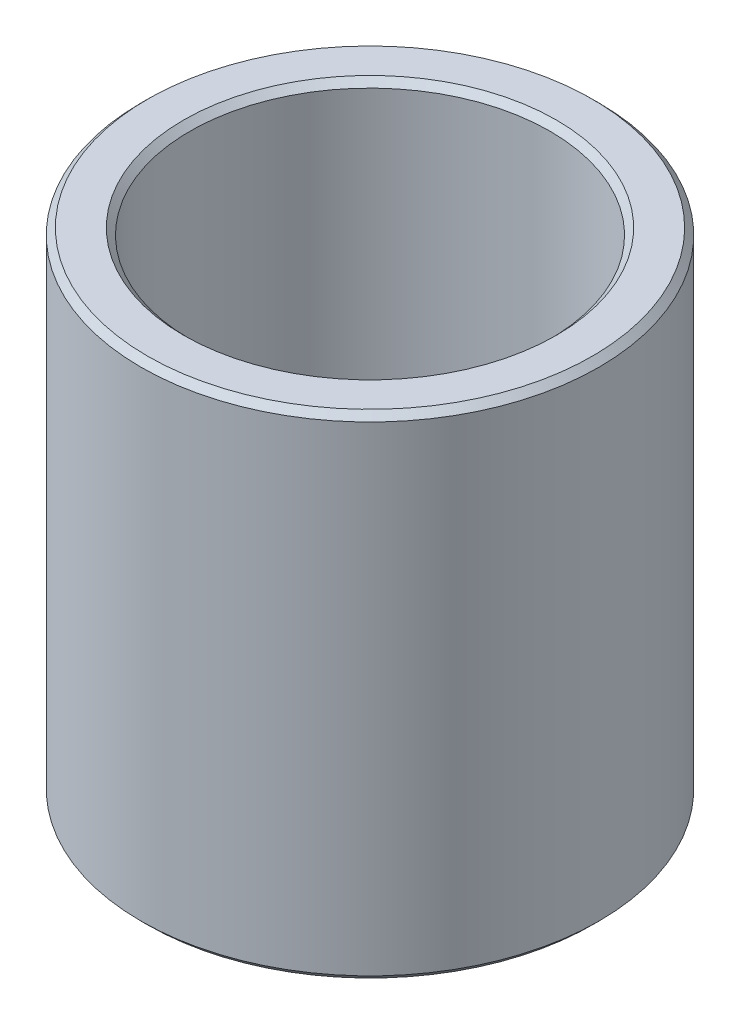
ISO-10303-21;
HEADER;
FILE_DESCRIPTION(('STEP AP214'),'2;1');
FILE_NAME('part.step','',(''),(''),'','','');
FILE_SCHEMA(('AUTOMOTIVE_DESIGN { 1 0 10303 214 1 1 1 1 }'));
ENDSEC;
DATA;
#1=APPLICATION_CONTEXT('core data for automotive mechanical design processes');
#2=APPLICATION_PROTOCOL_DEFINITION('international standard','automotive_design',2000,#1);
#3=PRODUCT_CONTEXT('',#1,'mechanical');
#4=PRODUCT('Part','Part','',(#3));
#5=PRODUCT_RELATED_PRODUCT_CATEGORY('part','',(#4));
#6=PRODUCT_DEFINITION_FORMATION('','',#4);
#7=PRODUCT_DEFINITION_CONTEXT('part definition',#1,'design');
#8=PRODUCT_DEFINITION('design','',#6,#7);
#9=PRODUCT_DEFINITION_SHAPE('','',#8);
#10=(LENGTH_UNIT() NAMED_UNIT(*) SI_UNIT(.MILLI.,.METRE.));
#11=(NAMED_UNIT(*) PLANE_ANGLE_UNIT() SI_UNIT($,.RADIAN.));
#12=(NAMED_UNIT(*) SI_UNIT($,.STERADIAN.) SOLID_ANGLE_UNIT());
#13=UNCERTAINTY_MEASURE_WITH_UNIT(LENGTH_MEASURE(1.E-05),#10,'distance_accuracy_value','');
#14=(GEOMETRIC_REPRESENTATION_CONTEXT(3) GLOBAL_UNCERTAINTY_ASSIGNED_CONTEXT((#13)) GLOBAL_UNIT_ASSIGNED_CONTEXT((#10,
#11,#12)) REPRESENTATION_CONTEXT('',''));
#15=CARTESIAN_POINT('',(0.,0.,0.));
#16=DIRECTION('',(0.,0.,1.));
#17=DIRECTION('',(1.,0.,0.));
#18=AXIS2_PLACEMENT_3D('',#15,#16,#17);
#19=CARTESIAN_POINT('',(0.,91.436440186991,0.));
#20=DIRECTION('',(0.,-1.,0.));
#21=DIRECTION('',(0.,0.,-1.));
#22=AXIS2_PLACEMENT_3D('',#19,#20,#21);
#23=CYLINDRICAL_SURFACE('',#22,42.5);
#24=CARTESIAN_POINT('',(0.,1.19448663631071,0.));
#25=DIRECTION('',(0.,1.,0.));
#26=DIRECTION('',(0.,0.,1.));
#27=AXIS2_PLACEMENT_3D('',#24,#25,#26);
#28=CIRCLE('',#27,42.5);
#29=CARTESIAN_POINT('',(0.,1.19448663631071,42.5));
#30=VERTEX_POINT('',#29);
#31=EDGE_CURVE('E10',#30,#30,#28,.T.);
#32=ORIENTED_EDGE('',*,*,#31,.T.);
#33=EDGE_LOOP('',(#32));
#34=FACE_BOUND('',#33,.T.);
#35=CARTESIAN_POINT('',(0.,90.2419535506802,0.));
#36=DIRECTION('',(0.,1.,0.));
#37=DIRECTION('',(0.,0.,1.));
#38=AXIS2_PLACEMENT_3D('',#35,#36,#37);
#39=CIRCLE('',#38,42.5);
#40=CARTESIAN_POINT('',(0.,90.2419535506802,42.5));
#41=VERTEX_POINT('',#40);
#42=EDGE_CURVE('E50',#41,#41,#39,.F.);
#43=ORIENTED_EDGE('',*,*,#42,.T.);
#44=EDGE_LOOP('',(#43));
#45=FACE_BOUND('',#44,.T.);
#46=ADVANCED_FACE('F39',(#34,#45),#23,.T.);
#47=CARTESIAN_POINT('',(0.,91.436440186991,0.));
#48=DIRECTION('',(0.,1.,0.));
#49=DIRECTION('',(0.,0.,1.));
#50=AXIS2_PLACEMENT_3D('',#47,#48,#49);
#51=PLANE('',#50);
#52=CARTESIAN_POINT('',(0.,91.436440186991,0.));
#53=DIRECTION('',(0.,1.,0.));
#54=DIRECTION('',(0.,0.,1.));
#55=AXIS2_PLACEMENT_3D('',#52,#53,#54);
#56=CIRCLE('',#55,34.6131338190383);
#57=CARTESIAN_POINT('',(0.,91.436440186991,34.6131338190383));
#58=VERTEX_POINT('',#57);
#59=EDGE_CURVE('E58',#58,#58,#56,.F.);
#60=ORIENTED_EDGE('',*,*,#59,.T.);
#61=EDGE_LOOP('',(#60));
#62=FACE_BOUND('',#61,.T.);
#63=CARTESIAN_POINT('',(0.,91.436440186991,0.));
#64=DIRECTION('',(0.,1.,0.));
#65=DIRECTION('',(0.,0.,1.));
#66=AXIS2_PLACEMENT_3D('',#63,#64,#65);
#67=CIRCLE('',#66,41.3055133636893);
#68=CARTESIAN_POINT('',(0.,91.436440186991,41.3055133636893));
#69=VERTEX_POINT('',#68);
#70=EDGE_CURVE('E61',#69,#69,#67,.T.);
#71=ORIENTED_EDGE('',*,*,#70,.T.);
#72=EDGE_LOOP('',(#71));
#73=FACE_BOUND('',#72,.T.);
#74=ADVANCED_FACE('F88',(#62,#73),#51,.T.);
#75=CARTESIAN_POINT('',(0.,0.,0.));
#76=DIRECTION('',(0.,1.,0.));
#77=DIRECTION('',(0.,0.,1.));
#78=AXIS2_PLACEMENT_3D('',#75,#76,#77);
#79=PLANE('',#78);
#80=CARTESIAN_POINT('',(0.,0.,0.));
#81=DIRECTION('',(0.,1.,0.));
#82=DIRECTION('',(0.,0.,1.));
#83=AXIS2_PLACEMENT_3D('',#80,#81,#82);
#84=CIRCLE('',#83,34.6131338190383);
#85=CARTESIAN_POINT('',(0.,0.,-34.6131338190383));
#86=VERTEX_POINT('',#85);
#87=EDGE_CURVE('E51',#86,#86,#84,.T.);
#88=ORIENTED_EDGE('',*,*,#87,.T.);
#89=EDGE_LOOP('',(#88));
#90=FACE_BOUND('',#89,.T.);
#91=CARTESIAN_POINT('',(0.,0.,0.));
#92=DIRECTION('',(0.,1.,0.));
#93=DIRECTION('',(0.,0.,1.));
#94=AXIS2_PLACEMENT_3D('',#91,#92,#93);
#95=CIRCLE('',#94,41.3055133636893);
#96=CARTESIAN_POINT('',(0.,0.,41.3055133636893));
#97=VERTEX_POINT('',#96);
#98=EDGE_CURVE('E54',#97,#97,#95,.F.);
#99=ORIENTED_EDGE('',*,*,#98,.T.);
#100=EDGE_LOOP('',(#99));
#101=FACE_BOUND('',#100,.T.);
#102=ADVANCED_FACE('F83',(#90,#101),#79,.F.);
#103=CARTESIAN_POINT('',(0.,91.436440186991,0.));
#104=DIRECTION('',(0.,-1.,0.));
#105=DIRECTION('',(0.,0.,-1.));
#106=AXIS2_PLACEMENT_3D('',#103,#104,#105);
#107=CYLINDRICAL_SURFACE('',#106,33.4186471827276);
#108=CARTESIAN_POINT('',(0.,90.2419535506803,0.));
#109=DIRECTION('',(0.,1.,0.));
#110=DIRECTION('',(0.,0.,1.));
#111=AXIS2_PLACEMENT_3D('',#108,#109,#110);
#112=CIRCLE('',#111,33.4186471827276);
#113=CARTESIAN_POINT('',(0.,90.2419535506803,33.4186471827276));
#114=VERTEX_POINT('',#113);
#115=EDGE_CURVE('E67',#114,#114,#112,.T.);
#116=ORIENTED_EDGE('',*,*,#115,.T.);
#117=EDGE_LOOP('',(#116));
#118=FACE_BOUND('',#117,.T.);
#119=CARTESIAN_POINT('',(0.,1.19448663631072,0.));
#120=DIRECTION('',(0.,1.,0.));
#121=DIRECTION('',(0.,0.,1.));
#122=AXIS2_PLACEMENT_3D('',#119,#120,#121);
#123=CIRCLE('',#122,33.4186471827276);
#124=CARTESIAN_POINT('',(0.,1.19448663631072,-33.4186471827276));
#125=VERTEX_POINT('',#124);
#126=EDGE_CURVE('E69',#125,#125,#123,.F.);
#127=ORIENTED_EDGE('',*,*,#126,.T.);
#128=EDGE_LOOP('',(#127));
#129=FACE_BOUND('',#128,.T.);
#130=ADVANCED_FACE('F71',(#118,#129),#107,.F.);
#131=CARTESIAN_POINT('',(0.,90.2419535506803,0.));
#132=DIRECTION('',(0.,1.,0.));
#133=DIRECTION('',(0.,0.,1.));
#134=AXIS2_PLACEMENT_3D('',#131,#132,#133);
#135=CONICAL_SURFACE('',#134,33.4186471827276,0.785398163397451);
#136=ORIENTED_EDGE('',*,*,#59,.F.);
#137=EDGE_LOOP('',(#136));
#138=FACE_BOUND('',#137,.T.);
#139=ORIENTED_EDGE('',*,*,#115,.F.);
#140=EDGE_LOOP('',(#139));
#141=FACE_BOUND('',#140,.T.);
#142=ADVANCED_FACE('F77',(#138,#141),#135,.F.);
#143=CARTESIAN_POINT('',(0.,0.,0.));
#144=DIRECTION('',(0.,-1.,0.));
#145=DIRECTION('',(0.,0.,-1.));
#146=AXIS2_PLACEMENT_3D('',#143,#144,#145);
#147=CONICAL_SURFACE('',#146,34.6131338190383,0.785398163397445);
#148=CARTESIAN_POINT('',(0.,1.19448663631072,-33.4186471827276));
#149=CARTESIAN_POINT('',(0.,1.18204406718248,-33.4310897518558));
#150=CARTESIAN_POINT('',(0.,1.16960149805425,-33.443532320984));
#151=CARTESIAN_POINT('',(0.,1.14471635979777,-33.4684174592405));
#152=CARTESIAN_POINT('',(0.,1.13227379066954,-33.4808600283688));
#153=CARTESIAN_POINT('',(0.,1.10738865241306,-33.5057451666252));
#154=CARTESIAN_POINT('',(0.,1.09494608328483,-33.5181877357535));
#155=CARTESIAN_POINT('',(0.,1.07006094502835,-33.5430728740099));
#156=CARTESIAN_POINT('',(0.,1.05761837590012,-33.5555154431382));
#157=CARTESIAN_POINT('',(0.,1.03273323764364,-33.5804005813946));
#158=CARTESIAN_POINT('',(0.,1.02029066851541,-33.5928431505229));
#159=CARTESIAN_POINT('',(0.,0.995405530258934,-33.6177282887794));
#160=CARTESIAN_POINT('',(0.,0.982962961130697,-33.6301708579076));
#161=CARTESIAN_POINT('',(0.,0.958077822874224,-33.6550559961641));
#162=CARTESIAN_POINT('',(0.,0.945635253745987,-33.6674985652923));
#163=CARTESIAN_POINT('',(0.,0.920750115489514,-33.6923837035488));
#164=CARTESIAN_POINT('',(0.,0.908307546361277,-33.704826272677));
#165=CARTESIAN_POINT('',(0.,0.883422408104804,-33.7297114109335));
#166=CARTESIAN_POINT('',(0.,0.870979838976567,-33.7421539800617));
#167=CARTESIAN_POINT('',(0.,0.846094700720094,-33.7670391183182));
#168=CARTESIAN_POINT('',(0.,0.833652131591857,-33.7794816874464));
#169=CARTESIAN_POINT('',(0.,0.808766993335384,-33.8043668257029));
#170=CARTESIAN_POINT('',(0.,0.796324424207147,-33.8168093948311));
#171=CARTESIAN_POINT('',(0.,0.771439285950674,-33.8416945330876));
#172=CARTESIAN_POINT('',(0.,0.758996716822437,-33.8541371022159));
#173=CARTESIAN_POINT('',(0.,0.734111578565964,-33.8790222404723));
#174=CARTESIAN_POINT('',(0.,0.721669009437727,-33.8914648096006));
#175=CARTESIAN_POINT('',(0.,0.696783871181254,-33.916349947857));
#176=CARTESIAN_POINT('',(0.,0.684341302053017,-33.9287925169853));
#177=CARTESIAN_POINT('',(0.,0.659456163796544,-33.9536776552417));
#178=CARTESIAN_POINT('',(0.,0.647013594668308,-33.96612022437));
#179=CARTESIAN_POINT('',(0.,0.622128456411834,-33.9910053626265));
#180=CARTESIAN_POINT('',(0.,0.609685887283597,-34.0034479317547));
#181=CARTESIAN_POINT('',(0.,0.584800749027123,-34.0283330700112));
#182=CARTESIAN_POINT('',(0.,0.572358179898887,-34.0407756391394));
#183=CARTESIAN_POINT('',(0.,0.547473041642414,-34.0656607773959));
#184=CARTESIAN_POINT('',(0.,0.535030472514177,-34.0781033465241));
#185=CARTESIAN_POINT('',(0.,0.510145334257704,-34.1029884847806));
#186=CARTESIAN_POINT('',(0.,0.497702765129467,-34.1154310539088));
#187=CARTESIAN_POINT('',(0.,0.472817626872994,-34.1403161921653));
#188=CARTESIAN_POINT('',(0.,0.460375057744757,-34.1527587612935));
#189=CARTESIAN_POINT('',(0.,0.435489919488284,-34.17764389955));
#190=CARTESIAN_POINT('',(0.,0.423047350360047,-34.1900864686782));
#191=CARTESIAN_POINT('',(0.,0.398162212103574,-34.2149716069347));
#192=CARTESIAN_POINT('',(0.,0.385719642975337,-34.2274141760629));
#193=CARTESIAN_POINT('',(0.,0.360834504718864,-34.2522993143194));
#194=CARTESIAN_POINT('',(0.,0.348391935590627,-34.2647418834477));
#195=CARTESIAN_POINT('',(0.,0.323506797334154,-34.2896270217041));
#196=CARTESIAN_POINT('',(0.,0.311064228205917,-34.3020695908324));
#197=CARTESIAN_POINT('',(0.,0.286179089949444,-34.3269547290888));
#198=CARTESIAN_POINT('',(0.,0.273736520821207,-34.3393972982171));
#199=CARTESIAN_POINT('',(0.,0.248851382564733,-34.3642824364736));
#200=CARTESIAN_POINT('',(0.,0.236408813436497,-34.3767250056018));
#201=CARTESIAN_POINT('',(0.,0.211523675180023,-34.4016101438583));
#202=CARTESIAN_POINT('',(0.,0.199081106051787,-34.4140527129865));
#203=CARTESIAN_POINT('',(0.,0.174195967795313,-34.438937851243));
#204=CARTESIAN_POINT('',(0.,0.161753398667077,-34.4513804203712));
#205=CARTESIAN_POINT('',(0.,0.136868260410603,-34.4762655586277));
#206=CARTESIAN_POINT('',(0.,0.124425691282367,-34.4887081277559));
#207=CARTESIAN_POINT('',(0.,0.0995405530258934,-34.5135932660124));
#208=CARTESIAN_POINT('',(0.,0.0870979838976567,-34.5260358351406));
#209=CARTESIAN_POINT('',(0.,0.0622128456411834,-34.5509209733971));
#210=CARTESIAN_POINT('',(0.,0.0497702765129467,-34.5633635425253));
#211=CARTESIAN_POINT('',(0.,0.0248851382564734,-34.5882486807818));
#212=CARTESIAN_POINT('',(0.,0.0124425691282367,-34.60069124991));
#213=CARTESIAN_POINT('',(0.,0.,-34.6131338190383));
#214=B_SPLINE_CURVE_WITH_KNOTS('',3,(#148,#149,#150,#151,#152,#153,#154,#155,#156,#157,#158,
#159,#160,#161,#162,#163,#164,#165,#166,#167,#168,#169,#170,#171,#172,#173,#174,#175,#176,#177,
#178,#179,#180,#181,#182,#183,#184,#185,#186,#187,#188,#189,#190,#191,#192,#193,#194,#195,#196,
#197,#198,#199,#200,#201,#202,#203,#204,#205,#206,#207,#208,#209,#210,#211,#212,#213),
.UNSPECIFIED.,.F.,.F.,(4,2,2,2,2,2,2,2,2,2,2,2,2,2,2,2,2,2,2,2,2,2,2,2,2,2,2,2,2,2,2,2,4),(0.,
0.0527893500357513,0.105578700071503,0.158368050107254,0.211157400143005,0.263946750178756,
0.316736100214507,0.369525450250259,0.42231480028601,0.475104150321761,0.527893500357513,
0.580682850393264,0.633472200429015,0.686261550464766,0.739050900500518,0.791840250536269,
0.844629600572015,0.897418950607767,0.950208300643518,1.00299765067927,1.05578700071502,
1.10857635075077,1.16136570078652,1.21415505082227,1.26694440085803,1.31973375089378,
1.37252310092953,1.42531245096528,1.47810180100103,1.53089115103678,1.58368050107253,
1.63646985110828,1.68925920114403),.UNSPECIFIED.);
#215=EDGE_CURVE('BSEAM73',#125,#86,#214,.T.);
#216=ORIENTED_EDGE('',*,*,#126,.F.);
#217=ORIENTED_EDGE('',*,*,#87,.F.);
#218=ORIENTED_EDGE('',*,*,#215,.T.);
#219=ORIENTED_EDGE('',*,*,#215,.F.);
#220=EDGE_LOOP('',(#216,#218,#217,#219));
#221=FACE_BOUND('',#220,.T.);
#222=ADVANCED_FACE('F73',(#221),#147,.F.);
#223=CARTESIAN_POINT('',(0.,1.19448663631071,0.));
#224=DIRECTION('',(0.,1.,0.));
#225=DIRECTION('',(0.,0.,1.));
#226=AXIS2_PLACEMENT_3D('',#223,#224,#225);
#227=CONICAL_SURFACE('',#226,42.5,0.785398163397448);
#228=ORIENTED_EDGE('',*,*,#98,.F.);
#229=EDGE_LOOP('',(#228));
#230=FACE_BOUND('',#229,.T.);
#231=ORIENTED_EDGE('',*,*,#31,.F.);
#232=EDGE_LOOP('',(#231));
#233=FACE_BOUND('',#232,.T.);
#234=ADVANCED_FACE('F76',(#230,#233),#227,.T.);
#235=CARTESIAN_POINT('',(0.,91.436440186991,0.));
#236=DIRECTION('',(0.,-1.,0.));
#237=DIRECTION('',(0.,0.,-1.));
#238=AXIS2_PLACEMENT_3D('',#235,#236,#237);
#239=CONICAL_SURFACE('',#238,41.3055133636893,0.785398163397443);
#240=ORIENTED_EDGE('',*,*,#42,.F.);
#241=EDGE_LOOP('',(#240));
#242=FACE_BOUND('',#241,.T.);
#243=ORIENTED_EDGE('',*,*,#70,.F.);
#244=EDGE_LOOP('',(#243));
#245=FACE_BOUND('',#244,.T.);
#246=ADVANCED_FACE('F45',(#242,#245),#239,.T.);
#247=CLOSED_SHELL('',(#46,#74,#102,#130,#142,#222,#234,#246));
#248=MANIFOLD_SOLID_BREP('B2',#247);
#249=ADVANCED_BREP_SHAPE_REPRESENTATION('',(#18,#248),#14);
#250=SHAPE_DEFINITION_REPRESENTATION(#9,#249);
ENDSEC;
END-ISO-10303-21;
